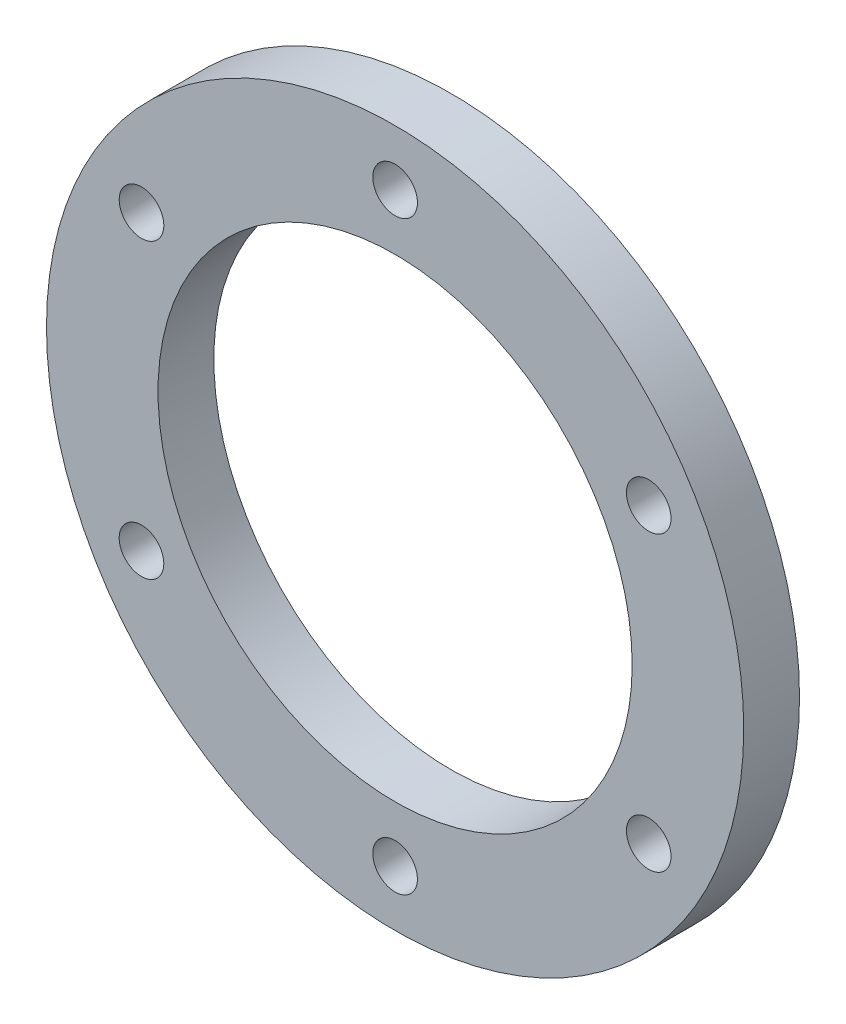
ISO-10303-21;
HEADER;
FILE_DESCRIPTION(('STEP AP214'),'2;1');
FILE_NAME('part.step','',(''),(''),'','','');
FILE_SCHEMA(('AUTOMOTIVE_DESIGN { 1 0 10303 214 1 1 1 1 }'));
ENDSEC;
DATA;
#1=APPLICATION_CONTEXT('core data for automotive mechanical design processes');
#2=APPLICATION_PROTOCOL_DEFINITION('international standard','automotive_design',2000,#1);
#3=PRODUCT_CONTEXT('',#1,'mechanical');
#4=PRODUCT('Part','Part','',(#3));
#5=PRODUCT_RELATED_PRODUCT_CATEGORY('part','',(#4));
#6=PRODUCT_DEFINITION_FORMATION('','',#4);
#7=PRODUCT_DEFINITION_CONTEXT('part definition',#1,'design');
#8=PRODUCT_DEFINITION('design','',#6,#7);
#9=PRODUCT_DEFINITION_SHAPE('','',#8);
#10=(LENGTH_UNIT() NAMED_UNIT(*) SI_UNIT(.MILLI.,.METRE.));
#11=(NAMED_UNIT(*) PLANE_ANGLE_UNIT() SI_UNIT($,.RADIAN.));
#12=(NAMED_UNIT(*) SI_UNIT($,.STERADIAN.) SOLID_ANGLE_UNIT());
#13=UNCERTAINTY_MEASURE_WITH_UNIT(LENGTH_MEASURE(1.E-05),#10,'distance_accuracy_value','');
#14=(GEOMETRIC_REPRESENTATION_CONTEXT(3) GLOBAL_UNCERTAINTY_ASSIGNED_CONTEXT((#13)) GLOBAL_UNIT_ASSIGNED_CONTEXT((#10,
#11,#12)) REPRESENTATION_CONTEXT('',''));
#15=CARTESIAN_POINT('',(0.,0.,0.));
#16=DIRECTION('',(0.,0.,1.));
#17=DIRECTION('',(1.,0.,0.));
#18=AXIS2_PLACEMENT_3D('',#15,#16,#17);
#19=CARTESIAN_POINT('',(0.,0.,5.));
#20=DIRECTION('',(0.,0.,1.));
#21=DIRECTION('',(1.,0.,0.));
#22=AXIS2_PLACEMENT_3D('',#19,#20,#21);
#23=PLANE('',#22);
#24=CARTESIAN_POINT('',(-45.4663336986827,26.2500000000005,5.));
#25=DIRECTION('',(0.,0.,1.));
#26=DIRECTION('',(0.50000000000001,0.866025403784433,0.));
#27=AXIS2_PLACEMENT_3D('',#24,#25,#26);
#28=CIRCLE('',#27,4.);
#29=CARTESIAN_POINT('',(-43.4663336986827,29.7141016151383,5.));
#30=VERTEX_POINT('',#29);
#31=EDGE_CURVE('E76',#30,#30,#28,.T.);
#32=ORIENTED_EDGE('',*,*,#31,.F.);
#33=EDGE_LOOP('',(#32));
#34=FACE_BOUND('',#33,.T.);
#35=CARTESIAN_POINT('',(-45.4663336986833,-26.2499999999996,5.));
#36=DIRECTION('',(0.,0.,1.));
#37=DIRECTION('',(-0.499999999999992,0.866025403784443,0.));
#38=AXIS2_PLACEMENT_3D('',#35,#36,#37);
#39=CIRCLE('',#38,4.);
#40=CARTESIAN_POINT('',(-47.4663336986832,-22.7858983848618,5.));
#41=VERTEX_POINT('',#40);
#42=EDGE_CURVE('E84',#41,#41,#39,.T.);
#43=ORIENTED_EDGE('',*,*,#42,.F.);
#44=EDGE_LOOP('',(#43));
#45=FACE_BOUND('',#44,.T.);
#46=CARTESIAN_POINT('',(0.,-52.5,5.));
#47=DIRECTION('',(0.,0.,1.));
#48=DIRECTION('',(-1.,0.,0.));
#49=AXIS2_PLACEMENT_3D('',#46,#47,#48);
#50=CIRCLE('',#49,4.);
#51=CARTESIAN_POINT('',(-4.,-52.5,5.));
#52=VERTEX_POINT('',#51);
#53=EDGE_CURVE('E92',#52,#52,#50,.T.);
#54=ORIENTED_EDGE('',*,*,#53,.F.);
#55=EDGE_LOOP('',(#54));
#56=FACE_BOUND('',#55,.T.);
#57=CARTESIAN_POINT('',(45.4663336986829,-26.2500000000002,5.));
#58=DIRECTION('',(0.,0.,1.));
#59=DIRECTION('',(-0.500000000000004,-0.866025403784436,0.));
#60=AXIS2_PLACEMENT_3D('',#57,#58,#59);
#61=CIRCLE('',#60,4.);
#62=CARTESIAN_POINT('',(43.4663336986829,-29.714101615138,5.));
#63=VERTEX_POINT('',#62);
#64=EDGE_CURVE('E100',#63,#63,#61,.T.);
#65=ORIENTED_EDGE('',*,*,#64,.F.);
#66=EDGE_LOOP('',(#65));
#67=FACE_BOUND('',#66,.T.);
#68=CARTESIAN_POINT('',(45.4663336986831,26.2499999999999,5.));
#69=DIRECTION('',(0.,0.,1.));
#70=DIRECTION('',(0.499999999999998,-0.86602540378444,0.));
#71=AXIS2_PLACEMENT_3D('',#68,#69,#70);
#72=CIRCLE('',#71,4.);
#73=CARTESIAN_POINT('',(47.4663336986831,22.7858983848621,5.));
#74=VERTEX_POINT('',#73);
#75=EDGE_CURVE('E68',#74,#74,#72,.T.);
#76=ORIENTED_EDGE('',*,*,#75,.F.);
#77=EDGE_LOOP('',(#76));
#78=FACE_BOUND('',#77,.T.);
#79=CARTESIAN_POINT('',(0.,52.5,5.));
#80=DIRECTION('',(0.,0.,1.));
#81=DIRECTION('',(1.,0.,0.));
#82=AXIS2_PLACEMENT_3D('',#79,#80,#81);
#83=CIRCLE('',#82,4.);
#84=CARTESIAN_POINT('',(4.,52.5,5.));
#85=VERTEX_POINT('',#84);
#86=EDGE_CURVE('E60',#85,#85,#83,.T.);
#87=ORIENTED_EDGE('',*,*,#86,.F.);
#88=EDGE_LOOP('',(#87));
#89=FACE_BOUND('',#88,.T.);
#90=CARTESIAN_POINT('',(0.,0.,5.));
#91=DIRECTION('',(0.,0.,1.));
#92=DIRECTION('',(1.,0.,0.));
#93=AXIS2_PLACEMENT_3D('',#90,#91,#92);
#94=CIRCLE('',#93,62.5);
#95=CARTESIAN_POINT('',(62.5,0.,5.));
#96=VERTEX_POINT('',#95);
#97=EDGE_CURVE('E10',#96,#96,#94,.T.);
#98=ORIENTED_EDGE('',*,*,#97,.T.);
#99=EDGE_LOOP('',(#98));
#100=FACE_BOUND('',#99,.T.);
#101=CARTESIAN_POINT('',(0.,0.,5.));
#102=DIRECTION('',(0.,0.,1.));
#103=DIRECTION('',(1.,0.,0.));
#104=AXIS2_PLACEMENT_3D('',#101,#102,#103);
#105=CIRCLE('',#104,42.5);
#106=CARTESIAN_POINT('',(42.5,0.,5.));
#107=VERTEX_POINT('',#106);
#108=EDGE_CURVE('E50',#107,#107,#105,.T.);
#109=ORIENTED_EDGE('',*,*,#108,.F.);
#110=EDGE_LOOP('',(#109));
#111=FACE_BOUND('',#110,.T.);
#112=ADVANCED_FACE('F36',(#34,#45,#56,#67,#78,#89,#100,#111),#23,.T.);
#113=CARTESIAN_POINT('',(0.,0.,-5.));
#114=DIRECTION('',(0.,0.,1.));
#115=DIRECTION('',(1.,0.,0.));
#116=AXIS2_PLACEMENT_3D('',#113,#114,#115);
#117=PLANE('',#116);
#118=CARTESIAN_POINT('',(-45.4663336986827,26.2500000000005,-5.));
#119=DIRECTION('',(0.,0.,1.));
#120=DIRECTION('',(0.50000000000001,0.866025403784433,0.));
#121=AXIS2_PLACEMENT_3D('',#118,#119,#120);
#122=CIRCLE('',#121,4.);
#123=CARTESIAN_POINT('',(-43.4663336986827,29.7141016151383,-5.));
#124=VERTEX_POINT('',#123);
#125=EDGE_CURVE('E80',#124,#124,#122,.T.);
#126=ORIENTED_EDGE('',*,*,#125,.T.);
#127=EDGE_LOOP('',(#126));
#128=FACE_BOUND('',#127,.T.);
#129=CARTESIAN_POINT('',(-45.4663336986833,-26.2499999999996,-5.));
#130=DIRECTION('',(0.,0.,1.));
#131=DIRECTION('',(-0.499999999999992,0.866025403784443,0.));
#132=AXIS2_PLACEMENT_3D('',#129,#130,#131);
#133=CIRCLE('',#132,4.);
#134=CARTESIAN_POINT('',(-47.4663336986832,-22.7858983848618,-5.));
#135=VERTEX_POINT('',#134);
#136=EDGE_CURVE('E88',#135,#135,#133,.T.);
#137=ORIENTED_EDGE('',*,*,#136,.T.);
#138=EDGE_LOOP('',(#137));
#139=FACE_BOUND('',#138,.T.);
#140=CARTESIAN_POINT('',(0.,-52.5,-5.));
#141=DIRECTION('',(0.,0.,1.));
#142=DIRECTION('',(-1.,0.,0.));
#143=AXIS2_PLACEMENT_3D('',#140,#141,#142);
#144=CIRCLE('',#143,4.);
#145=CARTESIAN_POINT('',(-4.,-52.5,-5.));
#146=VERTEX_POINT('',#145);
#147=EDGE_CURVE('E96',#146,#146,#144,.T.);
#148=ORIENTED_EDGE('',*,*,#147,.T.);
#149=EDGE_LOOP('',(#148));
#150=FACE_BOUND('',#149,.T.);
#151=CARTESIAN_POINT('',(45.4663336986829,-26.2500000000002,-5.));
#152=DIRECTION('',(0.,0.,1.));
#153=DIRECTION('',(-0.500000000000004,-0.866025403784436,0.));
#154=AXIS2_PLACEMENT_3D('',#151,#152,#153);
#155=CIRCLE('',#154,4.);
#156=CARTESIAN_POINT('',(43.4663336986829,-29.714101615138,-5.));
#157=VERTEX_POINT('',#156);
#158=EDGE_CURVE('E72',#157,#157,#155,.T.);
#159=ORIENTED_EDGE('',*,*,#158,.T.);
#160=EDGE_LOOP('',(#159));
#161=FACE_BOUND('',#160,.T.);
#162=CARTESIAN_POINT('',(45.4663336986831,26.2499999999999,-5.));
#163=DIRECTION('',(0.,0.,1.));
#164=DIRECTION('',(0.499999999999998,-0.86602540378444,0.));
#165=AXIS2_PLACEMENT_3D('',#162,#163,#164);
#166=CIRCLE('',#165,4.);
#167=CARTESIAN_POINT('',(47.4663336986831,22.7858983848621,-5.));
#168=VERTEX_POINT('',#167);
#169=EDGE_CURVE('E64',#168,#168,#166,.T.);
#170=ORIENTED_EDGE('',*,*,#169,.T.);
#171=EDGE_LOOP('',(#170));
#172=FACE_BOUND('',#171,.T.);
#173=CARTESIAN_POINT('',(0.,52.5,-5.));
#174=DIRECTION('',(0.,0.,1.));
#175=DIRECTION('',(1.,0.,0.));
#176=AXIS2_PLACEMENT_3D('',#173,#174,#175);
#177=CIRCLE('',#176,4.);
#178=CARTESIAN_POINT('',(4.,52.5,-5.));
#179=VERTEX_POINT('',#178);
#180=EDGE_CURVE('E56',#179,#179,#177,.T.);
#181=ORIENTED_EDGE('',*,*,#180,.T.);
#182=EDGE_LOOP('',(#181));
#183=FACE_BOUND('',#182,.T.);
#184=CARTESIAN_POINT('',(0.,0.,-5.));
#185=DIRECTION('',(0.,0.,1.));
#186=DIRECTION('',(1.,0.,0.));
#187=AXIS2_PLACEMENT_3D('',#184,#185,#186);
#188=CIRCLE('',#187,62.5);
#189=CARTESIAN_POINT('',(62.5,0.,-5.));
#190=VERTEX_POINT('',#189);
#191=EDGE_CURVE('E40',#190,#190,#188,.T.);
#192=ORIENTED_EDGE('',*,*,#191,.F.);
#193=EDGE_LOOP('',(#192));
#194=FACE_BOUND('',#193,.T.);
#195=CARTESIAN_POINT('',(0.,0.,-5.));
#196=DIRECTION('',(0.,0.,1.));
#197=DIRECTION('',(1.,0.,0.));
#198=AXIS2_PLACEMENT_3D('',#195,#196,#197);
#199=CIRCLE('',#198,42.5);
#200=CARTESIAN_POINT('',(42.5,0.,-5.));
#201=VERTEX_POINT('',#200);
#202=EDGE_CURVE('E52',#201,#201,#199,.T.);
#203=ORIENTED_EDGE('',*,*,#202,.T.);
#204=EDGE_LOOP('',(#203));
#205=FACE_BOUND('',#204,.T.);
#206=ADVANCED_FACE('F109',(#128,#139,#150,#161,#172,#183,#194,#205),#117,.F.);
#207=CARTESIAN_POINT('',(0.,0.,5.));
#208=DIRECTION('',(0.,0.,-1.));
#209=DIRECTION('',(-1.,0.,0.));
#210=AXIS2_PLACEMENT_3D('',#207,#208,#209);
#211=CYLINDRICAL_SURFACE('',#210,62.5);
#212=ORIENTED_EDGE('',*,*,#97,.F.);
#213=EDGE_LOOP('',(#212));
#214=FACE_BOUND('',#213,.T.);
#215=ORIENTED_EDGE('',*,*,#191,.T.);
#216=EDGE_LOOP('',(#215));
#217=FACE_BOUND('',#216,.T.);
#218=ADVANCED_FACE('F38',(#214,#217),#211,.T.);
#219=CARTESIAN_POINT('',(0.,0.,5.));
#220=DIRECTION('',(0.,0.,-1.));
#221=DIRECTION('',(-1.,0.,0.));
#222=AXIS2_PLACEMENT_3D('',#219,#220,#221);
#223=CYLINDRICAL_SURFACE('',#222,42.5);
#224=ORIENTED_EDGE('',*,*,#108,.T.);
#225=EDGE_LOOP('',(#224));
#226=FACE_BOUND('',#225,.T.);
#227=ORIENTED_EDGE('',*,*,#202,.F.);
#228=EDGE_LOOP('',(#227));
#229=FACE_BOUND('',#228,.T.);
#230=ADVANCED_FACE('F130',(#226,#229),#223,.F.);
#231=CARTESIAN_POINT('',(0.,52.5,-5.));
#232=DIRECTION('',(0.,0.,1.));
#233=DIRECTION('',(1.,0.,0.));
#234=AXIS2_PLACEMENT_3D('',#231,#232,#233);
#235=CYLINDRICAL_SURFACE('',#234,4.);
#236=ORIENTED_EDGE('',*,*,#180,.F.);
#237=EDGE_LOOP('',(#236));
#238=FACE_BOUND('',#237,.T.);
#239=ORIENTED_EDGE('',*,*,#86,.T.);
#240=EDGE_LOOP('',(#239));
#241=FACE_BOUND('',#240,.T.);
#242=ADVANCED_FACE('F133',(#238,#241),#235,.F.);
#243=CARTESIAN_POINT('',(45.4663336986831,26.2499999999999,-5.));
#244=DIRECTION('',(0.,0.,1.));
#245=DIRECTION('',(1.,0.,0.));
#246=AXIS2_PLACEMENT_3D('',#243,#244,#245);
#247=CYLINDRICAL_SURFACE('',#246,4.);
#248=ORIENTED_EDGE('',*,*,#169,.F.);
#249=EDGE_LOOP('',(#248));
#250=FACE_BOUND('',#249,.T.);
#251=ORIENTED_EDGE('',*,*,#75,.T.);
#252=EDGE_LOOP('',(#251));
#253=FACE_BOUND('',#252,.T.);
#254=ADVANCED_FACE('F116',(#250,#253),#247,.F.);
#255=CARTESIAN_POINT('',(45.4663336986829,-26.2500000000002,-5.));
#256=DIRECTION('',(0.,0.,1.));
#257=DIRECTION('',(1.,0.,0.));
#258=AXIS2_PLACEMENT_3D('',#255,#256,#257);
#259=CYLINDRICAL_SURFACE('',#258,4.);
#260=ORIENTED_EDGE('',*,*,#158,.F.);
#261=EDGE_LOOP('',(#260));
#262=FACE_BOUND('',#261,.T.);
#263=ORIENTED_EDGE('',*,*,#64,.T.);
#264=EDGE_LOOP('',(#263));
#265=FACE_BOUND('',#264,.T.);
#266=ADVANCED_FACE('F112',(#262,#265),#259,.F.);
#267=CARTESIAN_POINT('',(0.,-52.5,-5.));
#268=DIRECTION('',(0.,0.,1.));
#269=DIRECTION('',(1.,0.,0.));
#270=AXIS2_PLACEMENT_3D('',#267,#268,#269);
#271=CYLINDRICAL_SURFACE('',#270,4.);
#272=ORIENTED_EDGE('',*,*,#147,.F.);
#273=EDGE_LOOP('',(#272));
#274=FACE_BOUND('',#273,.T.);
#275=ORIENTED_EDGE('',*,*,#53,.T.);
#276=EDGE_LOOP('',(#275));
#277=FACE_BOUND('',#276,.T.);
#278=ADVANCED_FACE('F115',(#274,#277),#271,.F.);
#279=CARTESIAN_POINT('',(-45.4663336986833,-26.2499999999996,-5.));
#280=DIRECTION('',(0.,0.,1.));
#281=DIRECTION('',(1.,0.,0.));
#282=AXIS2_PLACEMENT_3D('',#279,#280,#281);
#283=CYLINDRICAL_SURFACE('',#282,4.);
#284=ORIENTED_EDGE('',*,*,#136,.F.);
#285=EDGE_LOOP('',(#284));
#286=FACE_BOUND('',#285,.T.);
#287=ORIENTED_EDGE('',*,*,#42,.T.);
#288=EDGE_LOOP('',(#287));
#289=FACE_BOUND('',#288,.T.);
#290=ADVANCED_FACE('F154',(#286,#289),#283,.F.);
#291=CARTESIAN_POINT('',(-45.4663336986827,26.2500000000005,-5.));
#292=DIRECTION('',(0.,0.,1.));
#293=DIRECTION('',(1.,0.,0.));
#294=AXIS2_PLACEMENT_3D('',#291,#292,#293);
#295=CYLINDRICAL_SURFACE('',#294,4.);
#296=ORIENTED_EDGE('',*,*,#125,.F.);
#297=EDGE_LOOP('',(#296));
#298=FACE_BOUND('',#297,.T.);
#299=ORIENTED_EDGE('',*,*,#31,.T.);
#300=EDGE_LOOP('',(#299));
#301=FACE_BOUND('',#300,.T.);
#302=ADVANCED_FACE('F151',(#298,#301),#295,.F.);
#303=CLOSED_SHELL('',(#112,#206,#218,#230,#242,#254,#266,#278,#290,#302));
#304=MANIFOLD_SOLID_BREP('B2',#303);
#305=ADVANCED_BREP_SHAPE_REPRESENTATION('',(#18,#304),#14);
#306=SHAPE_DEFINITION_REPRESENTATION(#9,#305);
ENDSEC;
END-ISO-10303-21;
